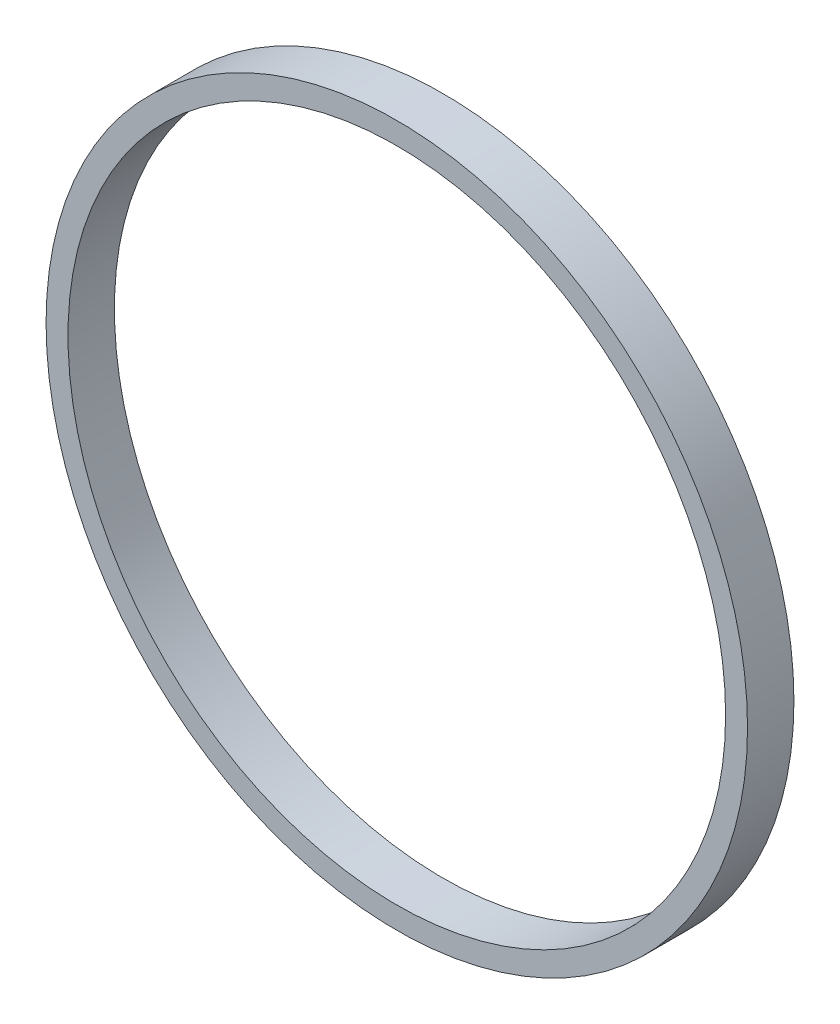
ISO-10303-21;
HEADER;
FILE_DESCRIPTION(('STEP AP214'),'2;1');
FILE_NAME('part.step','',(''),(''),'','','');
FILE_SCHEMA(('AUTOMOTIVE_DESIGN { 1 0 10303 214 1 1 1 1 }'));
ENDSEC;
DATA;
#1=APPLICATION_CONTEXT('core data for automotive mechanical design processes');
#2=APPLICATION_PROTOCOL_DEFINITION('international standard','automotive_design',2000,#1);
#3=PRODUCT_CONTEXT('',#1,'mechanical');
#4=PRODUCT('Part','Part','',(#3));
#5=PRODUCT_RELATED_PRODUCT_CATEGORY('part','',(#4));
#6=PRODUCT_DEFINITION_FORMATION('','',#4);
#7=PRODUCT_DEFINITION_CONTEXT('part definition',#1,'design');
#8=PRODUCT_DEFINITION('design','',#6,#7);
#9=PRODUCT_DEFINITION_SHAPE('','',#8);
#10=(LENGTH_UNIT() NAMED_UNIT(*) SI_UNIT(.MILLI.,.METRE.));
#11=(NAMED_UNIT(*) PLANE_ANGLE_UNIT() SI_UNIT($,.RADIAN.));
#12=(NAMED_UNIT(*) SI_UNIT($,.STERADIAN.) SOLID_ANGLE_UNIT());
#13=UNCERTAINTY_MEASURE_WITH_UNIT(LENGTH_MEASURE(1.E-05),#10,'distance_accuracy_value','');
#14=(GEOMETRIC_REPRESENTATION_CONTEXT(3) GLOBAL_UNCERTAINTY_ASSIGNED_CONTEXT((#13)) GLOBAL_UNIT_ASSIGNED_CONTEXT((#10,
#11,#12)) REPRESENTATION_CONTEXT('',''));
#15=CARTESIAN_POINT('',(0.,0.,0.));
#16=DIRECTION('',(0.,0.,1.));
#17=DIRECTION('',(1.,0.,0.));
#18=AXIS2_PLACEMENT_3D('',#15,#16,#17);
#19=CARTESIAN_POINT('',(0.,0.,3.175));
#20=DIRECTION('',(0.,0.,1.));
#21=DIRECTION('',(1.,0.,0.));
#22=AXIS2_PLACEMENT_3D('',#19,#20,#21);
#23=PLANE('',#22);
#24=CARTESIAN_POINT('',(0.,0.,3.175));
#25=DIRECTION('',(0.,0.,1.));
#26=DIRECTION('',(1.,0.,0.));
#27=AXIS2_PLACEMENT_3D('',#24,#25,#26);
#28=CIRCLE('',#27,24.);
#29=CARTESIAN_POINT('',(24.,0.,3.175));
#30=VERTEX_POINT('',#29);
#31=EDGE_CURVE('E10',#30,#30,#28,.T.);
#32=ORIENTED_EDGE('',*,*,#31,.T.);
#33=EDGE_LOOP('',(#32));
#34=FACE_BOUND('',#33,.T.);
#35=CARTESIAN_POINT('',(0.,0.,3.175));
#36=DIRECTION('',(0.,0.,1.));
#37=DIRECTION('',(1.,0.,0.));
#38=AXIS2_PLACEMENT_3D('',#35,#36,#37);
#39=CIRCLE('',#38,22.5);
#40=CARTESIAN_POINT('',(22.5,0.,3.175));
#41=VERTEX_POINT('',#40);
#42=EDGE_CURVE('E42',#41,#41,#39,.T.);
#43=ORIENTED_EDGE('',*,*,#42,.F.);
#44=EDGE_LOOP('',(#43));
#45=FACE_BOUND('',#44,.T.);
#46=ADVANCED_FACE('F31',(#34,#45),#23,.T.);
#47=CARTESIAN_POINT('',(0.,0.,0.));
#48=DIRECTION('',(0.,0.,1.));
#49=DIRECTION('',(1.,0.,0.));
#50=AXIS2_PLACEMENT_3D('',#47,#48,#49);
#51=PLANE('',#50);
#52=CARTESIAN_POINT('',(0.,0.,0.));
#53=DIRECTION('',(0.,0.,1.));
#54=DIRECTION('',(1.,0.,0.));
#55=AXIS2_PLACEMENT_3D('',#52,#53,#54);
#56=CIRCLE('',#55,24.);
#57=CARTESIAN_POINT('',(24.,0.,0.));
#58=VERTEX_POINT('',#57);
#59=EDGE_CURVE('E35',#58,#58,#56,.T.);
#60=ORIENTED_EDGE('',*,*,#59,.F.);
#61=EDGE_LOOP('',(#60));
#62=FACE_BOUND('',#61,.T.);
#63=CARTESIAN_POINT('',(0.,0.,0.));
#64=DIRECTION('',(0.,0.,1.));
#65=DIRECTION('',(1.,0.,0.));
#66=AXIS2_PLACEMENT_3D('',#63,#64,#65);
#67=CIRCLE('',#66,22.5);
#68=CARTESIAN_POINT('',(22.5,0.,0.));
#69=VERTEX_POINT('',#68);
#70=EDGE_CURVE('E44',#69,#69,#67,.T.);
#71=ORIENTED_EDGE('',*,*,#70,.T.);
#72=EDGE_LOOP('',(#71));
#73=FACE_BOUND('',#72,.T.);
#74=ADVANCED_FACE('F54',(#62,#73),#51,.F.);
#75=CARTESIAN_POINT('',(0.,0.,3.175));
#76=DIRECTION('',(0.,0.,-1.));
#77=DIRECTION('',(-1.,0.,0.));
#78=AXIS2_PLACEMENT_3D('',#75,#76,#77);
#79=CYLINDRICAL_SURFACE('',#78,24.);
#80=ORIENTED_EDGE('',*,*,#31,.F.);
#81=EDGE_LOOP('',(#80));
#82=FACE_BOUND('',#81,.T.);
#83=ORIENTED_EDGE('',*,*,#59,.T.);
#84=EDGE_LOOP('',(#83));
#85=FACE_BOUND('',#84,.T.);
#86=ADVANCED_FACE('F33',(#82,#85),#79,.T.);
#87=CARTESIAN_POINT('',(0.,0.,3.175));
#88=DIRECTION('',(0.,0.,-1.));
#89=DIRECTION('',(-1.,0.,0.));
#90=AXIS2_PLACEMENT_3D('',#87,#88,#89);
#91=CYLINDRICAL_SURFACE('',#90,22.5);
#92=ORIENTED_EDGE('',*,*,#42,.T.);
#93=EDGE_LOOP('',(#92));
#94=FACE_BOUND('',#93,.T.);
#95=ORIENTED_EDGE('',*,*,#70,.F.);
#96=EDGE_LOOP('',(#95));
#97=FACE_BOUND('',#96,.T.);
#98=ADVANCED_FACE('F50',(#94,#97),#91,.F.);
#99=CLOSED_SHELL('',(#46,#74,#86,#98));
#100=MANIFOLD_SOLID_BREP('B2',#99);
#101=ADVANCED_BREP_SHAPE_REPRESENTATION('',(#18,#100),#14);
#102=SHAPE_DEFINITION_REPRESENTATION(#9,#101);
ENDSEC;
END-ISO-10303-21;
